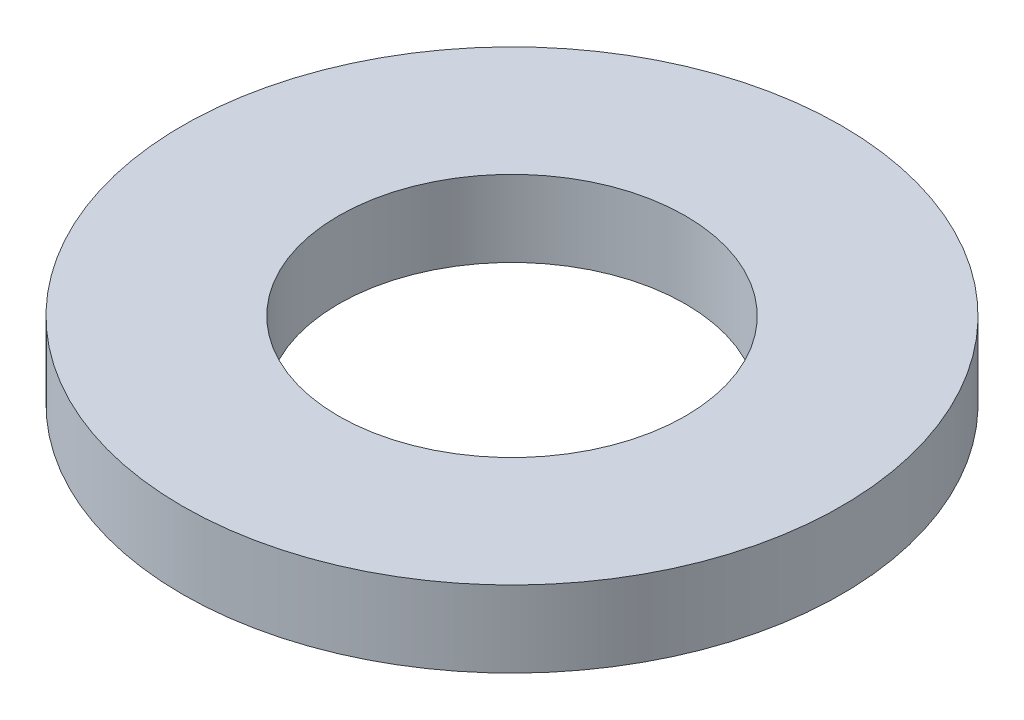
ISO-10303-21;
HEADER;
FILE_DESCRIPTION(('STEP AP214'),'2;1');
FILE_NAME('part.step','',(''),(''),'','','');
FILE_SCHEMA(('AUTOMOTIVE_DESIGN { 1 0 10303 214 1 1 1 1 }'));
ENDSEC;
DATA;
#1=APPLICATION_CONTEXT('core data for automotive mechanical design processes');
#2=APPLICATION_PROTOCOL_DEFINITION('international standard','automotive_design',2000,#1);
#3=PRODUCT_CONTEXT('',#1,'mechanical');
#4=PRODUCT('Part','Part','',(#3));
#5=PRODUCT_RELATED_PRODUCT_CATEGORY('part','',(#4));
#6=PRODUCT_DEFINITION_FORMATION('','',#4);
#7=PRODUCT_DEFINITION_CONTEXT('part definition',#1,'design');
#8=PRODUCT_DEFINITION('design','',#6,#7);
#9=PRODUCT_DEFINITION_SHAPE('','',#8);
#10=(LENGTH_UNIT() NAMED_UNIT(*) SI_UNIT(.MILLI.,.METRE.));
#11=(NAMED_UNIT(*) PLANE_ANGLE_UNIT() SI_UNIT($,.RADIAN.));
#12=(NAMED_UNIT(*) SI_UNIT($,.STERADIAN.) SOLID_ANGLE_UNIT());
#13=UNCERTAINTY_MEASURE_WITH_UNIT(LENGTH_MEASURE(1.E-05),#10,'distance_accuracy_value','');
#14=(GEOMETRIC_REPRESENTATION_CONTEXT(3) GLOBAL_UNCERTAINTY_ASSIGNED_CONTEXT((#13)) GLOBAL_UNIT_ASSIGNED_CONTEXT((#10,
#11,#12)) REPRESENTATION_CONTEXT('',''));
#15=CARTESIAN_POINT('',(0.,0.,0.));
#16=DIRECTION('',(0.,0.,1.));
#17=DIRECTION('',(1.,0.,0.));
#18=AXIS2_PLACEMENT_3D('',#15,#16,#17);
#19=CARTESIAN_POINT('',(0.,22.,0.));
#20=DIRECTION('',(0.,-1.,0.));
#21=DIRECTION('',(0.,0.,-1.));
#22=AXIS2_PLACEMENT_3D('',#19,#20,#21);
#23=CYLINDRICAL_SURFACE('',#22,95.);
#24=CARTESIAN_POINT('',(0.,22.,0.));
#25=DIRECTION('',(0.,1.,0.));
#26=DIRECTION('',(0.,0.,1.));
#27=AXIS2_PLACEMENT_3D('',#24,#25,#26);
#28=CIRCLE('',#27,95.);
#29=CARTESIAN_POINT('',(0.,22.,95.));
#30=VERTEX_POINT('',#29);
#31=EDGE_CURVE('E10',#30,#30,#28,.T.);
#32=ORIENTED_EDGE('',*,*,#31,.F.);
#33=EDGE_LOOP('',(#32));
#34=FACE_BOUND('',#33,.T.);
#35=CARTESIAN_POINT('',(0.,0.,0.));
#36=DIRECTION('',(0.,1.,0.));
#37=DIRECTION('',(0.,0.,1.));
#38=AXIS2_PLACEMENT_3D('',#35,#36,#37);
#39=CIRCLE('',#38,95.);
#40=CARTESIAN_POINT('',(0.,0.,95.));
#41=VERTEX_POINT('',#40);
#42=EDGE_CURVE('E37',#41,#41,#39,.T.);
#43=ORIENTED_EDGE('',*,*,#42,.T.);
#44=EDGE_LOOP('',(#43));
#45=FACE_BOUND('',#44,.T.);
#46=ADVANCED_FACE('F40',(#34,#45),#23,.T.);
#47=CARTESIAN_POINT('',(0.,22.,0.));
#48=DIRECTION('',(0.,1.,0.));
#49=DIRECTION('',(0.,0.,1.));
#50=AXIS2_PLACEMENT_3D('',#47,#48,#49);
#51=PLANE('',#50);
#52=CARTESIAN_POINT('',(0.,22.,0.));
#53=DIRECTION('',(0.,1.,0.));
#54=DIRECTION('',(0.,0.,1.));
#55=AXIS2_PLACEMENT_3D('',#52,#53,#54);
#56=CIRCLE('',#55,50.);
#57=CARTESIAN_POINT('',(0.,22.,50.));
#58=VERTEX_POINT('',#57);
#59=EDGE_CURVE('E50',#58,#58,#56,.T.);
#60=ORIENTED_EDGE('',*,*,#59,.F.);
#61=EDGE_LOOP('',(#60));
#62=FACE_BOUND('',#61,.T.);
#63=ORIENTED_EDGE('',*,*,#31,.T.);
#64=EDGE_LOOP('',(#63));
#65=FACE_BOUND('',#64,.T.);
#66=ADVANCED_FACE('F59',(#62,#65),#51,.T.);
#67=CARTESIAN_POINT('',(0.,0.,0.));
#68=DIRECTION('',(0.,1.,0.));
#69=DIRECTION('',(0.,0.,1.));
#70=AXIS2_PLACEMENT_3D('',#67,#68,#69);
#71=PLANE('',#70);
#72=CARTESIAN_POINT('',(0.,0.,0.));
#73=DIRECTION('',(0.,1.,0.));
#74=DIRECTION('',(0.,0.,1.));
#75=AXIS2_PLACEMENT_3D('',#72,#73,#74);
#76=CIRCLE('',#75,50.);
#77=CARTESIAN_POINT('',(0.,0.,50.));
#78=VERTEX_POINT('',#77);
#79=EDGE_CURVE('E47',#78,#78,#76,.T.);
#80=ORIENTED_EDGE('',*,*,#79,.T.);
#81=EDGE_LOOP('',(#80));
#82=FACE_BOUND('',#81,.T.);
#83=ORIENTED_EDGE('',*,*,#42,.F.);
#84=EDGE_LOOP('',(#83));
#85=FACE_BOUND('',#84,.T.);
#86=ADVANCED_FACE('F58',(#82,#85),#71,.F.);
#87=CARTESIAN_POINT('',(0.,22.,0.));
#88=DIRECTION('',(0.,-1.,0.));
#89=DIRECTION('',(0.,0.,-1.));
#90=AXIS2_PLACEMENT_3D('',#87,#88,#89);
#91=CYLINDRICAL_SURFACE('',#90,50.);
#92=ORIENTED_EDGE('',*,*,#59,.T.);
#93=EDGE_LOOP('',(#92));
#94=FACE_BOUND('',#93,.T.);
#95=ORIENTED_EDGE('',*,*,#79,.F.);
#96=EDGE_LOOP('',(#95));
#97=FACE_BOUND('',#96,.T.);
#98=ADVANCED_FACE('F54',(#94,#97),#91,.F.);
#99=CLOSED_SHELL('',(#46,#66,#86,#98));
#100=MANIFOLD_SOLID_BREP('B2',#99);
#101=ADVANCED_BREP_SHAPE_REPRESENTATION('',(#18,#100),#14);
#102=SHAPE_DEFINITION_REPRESENTATION(#9,#101);
ENDSEC;
END-ISO-10303-21;
